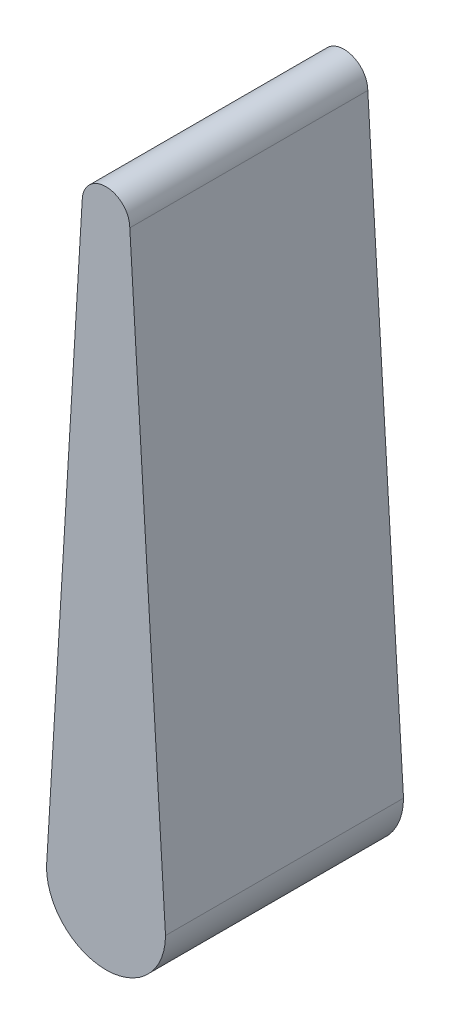
ISO-10303-21;
HEADER;
FILE_DESCRIPTION(('STEP AP214'),'2;1');
FILE_NAME('part.step','',(''),(''),'','','');
FILE_SCHEMA(('AUTOMOTIVE_DESIGN { 1 0 10303 214 1 1 1 1 }'));
ENDSEC;
DATA;
#1=APPLICATION_CONTEXT('core data for automotive mechanical design processes');
#2=APPLICATION_PROTOCOL_DEFINITION('international standard','automotive_design',2000,#1);
#3=PRODUCT_CONTEXT('',#1,'mechanical');
#4=PRODUCT('Part','Part','',(#3));
#5=PRODUCT_RELATED_PRODUCT_CATEGORY('part','',(#4));
#6=PRODUCT_DEFINITION_FORMATION('','',#4);
#7=PRODUCT_DEFINITION_CONTEXT('part definition',#1,'design');
#8=PRODUCT_DEFINITION('design','',#6,#7);
#9=PRODUCT_DEFINITION_SHAPE('','',#8);
#10=(LENGTH_UNIT() NAMED_UNIT(*) SI_UNIT(.MILLI.,.METRE.));
#11=(NAMED_UNIT(*) PLANE_ANGLE_UNIT() SI_UNIT($,.RADIAN.));
#12=(NAMED_UNIT(*) SI_UNIT($,.STERADIAN.) SOLID_ANGLE_UNIT());
#13=UNCERTAINTY_MEASURE_WITH_UNIT(LENGTH_MEASURE(1.E-05),#10,'distance_accuracy_value','');
#14=(GEOMETRIC_REPRESENTATION_CONTEXT(3) GLOBAL_UNCERTAINTY_ASSIGNED_CONTEXT((#13)) GLOBAL_UNIT_ASSIGNED_CONTEXT((#10,
#11,#12)) REPRESENTATION_CONTEXT('',''));
#15=CARTESIAN_POINT('',(0.,0.,0.));
#16=DIRECTION('',(0.,0.,1.));
#17=DIRECTION('',(1.,0.,0.));
#18=AXIS2_PLACEMENT_3D('',#15,#16,#17);
#19=CARTESIAN_POINT('',(0.,31.75,6.35));
#20=DIRECTION('',(0.,0.,-1.));
#21=DIRECTION('',(-1.,0.,0.));
#22=AXIS2_PLACEMENT_3D('',#19,#20,#21);
#23=CYLINDRICAL_SURFACE('',#22,1.27);
#24=CARTESIAN_POINT('',(0.,31.75,-6.35));
#25=DIRECTION('',(0.,0.,1.));
#26=DIRECTION('',(1.,0.,0.));
#27=AXIS2_PLACEMENT_3D('',#24,#25,#26);
#28=CIRCLE('',#27,1.27);
#29=CARTESIAN_POINT('',(1.27,31.75,-6.35));
#30=VERTEX_POINT('',#29);
#31=CARTESIAN_POINT('',(-1.27,31.75,-6.35));
#32=VERTEX_POINT('',#31);
#33=EDGE_CURVE('E113',#30,#32,#28,.T.);
#34=ORIENTED_EDGE('',*,*,#33,.T.);
#35=DIRECTION('',(0.,0.,-1.));
#36=VECTOR('',#35,1.);
#37=CARTESIAN_POINT('',(-1.27,31.75,6.35));
#38=LINE('',#37,#36);
#39=CARTESIAN_POINT('',(-1.27,31.75,6.35));
#40=VERTEX_POINT('',#39);
#41=EDGE_CURVE('E11',#40,#32,#38,.T.);
#42=ORIENTED_EDGE('',*,*,#41,.F.);
#43=CARTESIAN_POINT('',(0.,31.75,6.35));
#44=DIRECTION('',(0.,0.,1.));
#45=DIRECTION('',(1.,0.,0.));
#46=AXIS2_PLACEMENT_3D('',#43,#44,#45);
#47=CIRCLE('',#46,1.27);
#48=CARTESIAN_POINT('',(1.27,31.75,6.35));
#49=VERTEX_POINT('',#48);
#50=EDGE_CURVE('E85',#49,#40,#47,.T.);
#51=ORIENTED_EDGE('',*,*,#50,.F.);
#52=DIRECTION('',(0.,0.,-1.));
#53=VECTOR('',#52,1.);
#54=CARTESIAN_POINT('',(1.27,31.75,6.35));
#55=LINE('',#54,#53);
#56=EDGE_CURVE('E60',#49,#30,#55,.T.);
#57=ORIENTED_EDGE('',*,*,#56,.T.);
#58=EDGE_LOOP('',(#34,#42,#51,#57));
#59=FACE_BOUND('',#58,.T.);
#60=ADVANCED_FACE('F43',(#59),#23,.T.);
#61=CARTESIAN_POINT('',(-3.175,0.,6.35));
#62=DIRECTION('',(-0.998204845465779,0.0598922907279467,0.));
#63=DIRECTION('',(-0.0598922907279467,-0.998204845465779,0.));
#64=AXIS2_PLACEMENT_3D('',#61,#62,#63);
#65=PLANE('',#64);
#66=DIRECTION('',(0.0598922907279467,0.998204845465779,0.));
#67=VECTOR('',#66,1.);
#68=CARTESIAN_POINT('',(-3.175,0.,-6.35));
#69=LINE('',#68,#67);
#70=CARTESIAN_POINT('',(-3.175,0.,-6.35));
#71=VERTEX_POINT('',#70);
#72=EDGE_CURVE('E95',#71,#32,#69,.T.);
#73=ORIENTED_EDGE('',*,*,#72,.F.);
#74=DIRECTION('',(0.,0.,-1.));
#75=VECTOR('',#74,1.);
#76=CARTESIAN_POINT('',(-3.175,0.,6.35));
#77=LINE('',#76,#75);
#78=CARTESIAN_POINT('',(-3.175,0.,6.35));
#79=VERTEX_POINT('',#78);
#80=EDGE_CURVE('E52',#79,#71,#77,.T.);
#81=ORIENTED_EDGE('',*,*,#80,.F.);
#82=DIRECTION('',(0.0598922907279467,0.998204845465779,0.));
#83=VECTOR('',#82,1.);
#84=CARTESIAN_POINT('',(-3.175,0.,6.35));
#85=LINE('',#84,#83);
#86=EDGE_CURVE('E93',#79,#40,#85,.T.);
#87=ORIENTED_EDGE('',*,*,#86,.T.);
#88=ORIENTED_EDGE('',*,*,#41,.T.);
#89=EDGE_LOOP('',(#73,#81,#87,#88));
#90=FACE_BOUND('',#89,.T.);
#91=ADVANCED_FACE('F92',(#90),#65,.T.);
#92=CARTESIAN_POINT('',(0.,0.,6.35));
#93=DIRECTION('',(0.,0.,-1.));
#94=DIRECTION('',(-1.,0.,0.));
#95=AXIS2_PLACEMENT_3D('',#92,#93,#94);
#96=CYLINDRICAL_SURFACE('',#95,3.175);
#97=CARTESIAN_POINT('',(0.,0.,-6.35));
#98=DIRECTION('',(0.,0.,1.));
#99=DIRECTION('',(1.,0.,0.));
#100=AXIS2_PLACEMENT_3D('',#97,#98,#99);
#101=CIRCLE('',#100,3.175);
#102=CARTESIAN_POINT('',(3.175,0.,-6.35));
#103=VERTEX_POINT('',#102);
#104=EDGE_CURVE('E118',#71,#103,#101,.T.);
#105=ORIENTED_EDGE('',*,*,#104,.T.);
#106=DIRECTION('',(0.,0.,-1.));
#107=VECTOR('',#106,1.);
#108=CARTESIAN_POINT('',(3.175,0.,6.35));
#109=LINE('',#108,#107);
#110=CARTESIAN_POINT('',(3.175,0.,6.35));
#111=VERTEX_POINT('',#110);
#112=EDGE_CURVE('E74',#111,#103,#109,.T.);
#113=ORIENTED_EDGE('',*,*,#112,.F.);
#114=CARTESIAN_POINT('',(0.,0.,6.35));
#115=DIRECTION('',(0.,0.,1.));
#116=DIRECTION('',(1.,0.,0.));
#117=AXIS2_PLACEMENT_3D('',#114,#115,#116);
#118=CIRCLE('',#117,3.175);
#119=EDGE_CURVE('E99',#79,#111,#118,.T.);
#120=ORIENTED_EDGE('',*,*,#119,.F.);
#121=ORIENTED_EDGE('',*,*,#80,.T.);
#122=EDGE_LOOP('',(#105,#113,#120,#121));
#123=FACE_BOUND('',#122,.T.);
#124=ADVANCED_FACE('F100',(#123),#96,.T.);
#125=CARTESIAN_POINT('',(1.27,31.75,6.35));
#126=DIRECTION('',(0.998204845465779,0.0598922907279467,0.));
#127=DIRECTION('',(-0.0598922907279467,0.998204845465779,0.));
#128=AXIS2_PLACEMENT_3D('',#125,#126,#127);
#129=PLANE('',#128);
#130=DIRECTION('',(0.0598922907279467,-0.998204845465779,0.));
#131=VECTOR('',#130,1.);
#132=CARTESIAN_POINT('',(1.27,31.75,-6.35));
#133=LINE('',#132,#131);
#134=EDGE_CURVE('E108',#30,#103,#133,.T.);
#135=ORIENTED_EDGE('',*,*,#134,.F.);
#136=ORIENTED_EDGE('',*,*,#56,.F.);
#137=DIRECTION('',(0.0598922907279467,-0.998204845465779,0.));
#138=VECTOR('',#137,1.);
#139=CARTESIAN_POINT('',(1.27,31.75,6.35));
#140=LINE('',#139,#138);
#141=EDGE_CURVE('E102',#49,#111,#140,.T.);
#142=ORIENTED_EDGE('',*,*,#141,.T.);
#143=ORIENTED_EDGE('',*,*,#112,.T.);
#144=EDGE_LOOP('',(#135,#136,#142,#143));
#145=FACE_BOUND('',#144,.T.);
#146=ADVANCED_FACE('F129',(#145),#129,.T.);
#147=CARTESIAN_POINT('',(0.,31.75,6.35));
#148=DIRECTION('',(0.,0.,1.));
#149=DIRECTION('',(1.,0.,0.));
#150=AXIS2_PLACEMENT_3D('',#147,#148,#149);
#151=PLANE('',#150);
#152=ORIENTED_EDGE('',*,*,#50,.T.);
#153=ORIENTED_EDGE('',*,*,#86,.F.);
#154=ORIENTED_EDGE('',*,*,#119,.T.);
#155=ORIENTED_EDGE('',*,*,#141,.F.);
#156=EDGE_LOOP('',(#152,#153,#154,#155));
#157=FACE_BOUND('',#156,.T.);
#158=ADVANCED_FACE('F104',(#157),#151,.T.);
#159=CARTESIAN_POINT('',(0.,31.75,-6.35));
#160=DIRECTION('',(0.,0.,1.));
#161=DIRECTION('',(1.,0.,0.));
#162=AXIS2_PLACEMENT_3D('',#159,#160,#161);
#163=PLANE('',#162);
#164=ORIENTED_EDGE('',*,*,#33,.F.);
#165=ORIENTED_EDGE('',*,*,#134,.T.);
#166=ORIENTED_EDGE('',*,*,#104,.F.);
#167=ORIENTED_EDGE('',*,*,#72,.T.);
#168=EDGE_LOOP('',(#164,#165,#166,#167));
#169=FACE_BOUND('',#168,.T.);
#170=ADVANCED_FACE('F128',(#169),#163,.F.);
#171=CLOSED_SHELL('',(#60,#91,#124,#146,#158,#170));
#172=MANIFOLD_SOLID_BREP('B2',#171);
#173=ADVANCED_BREP_SHAPE_REPRESENTATION('',(#18,#172),#14);
#174=SHAPE_DEFINITION_REPRESENTATION(#9,#173);
ENDSEC;
END-ISO-10303-21;
